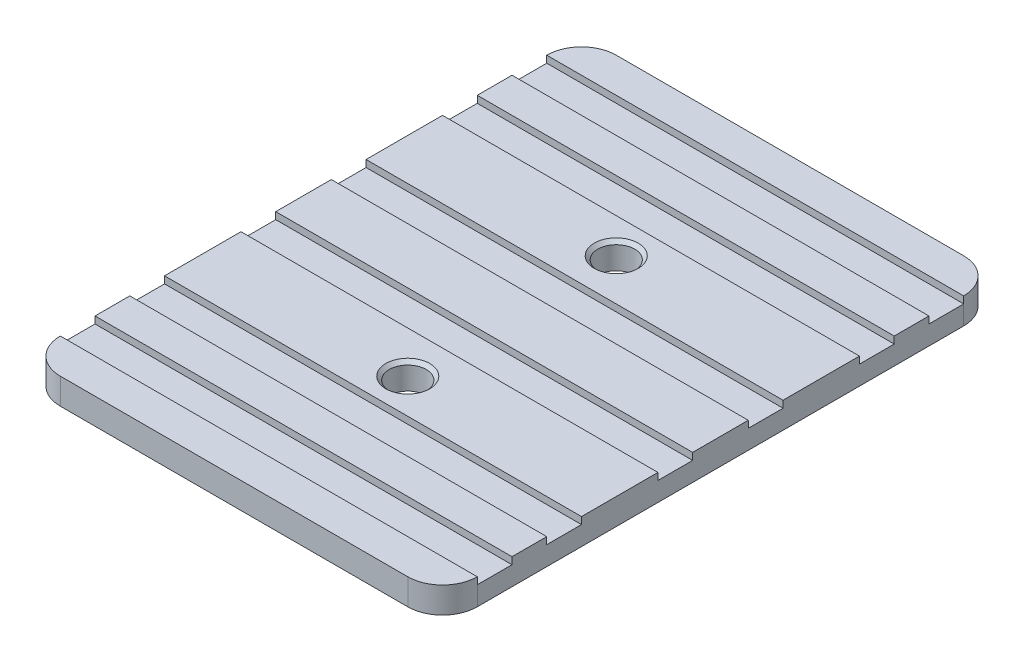
ISO-10303-21;
HEADER;
FILE_DESCRIPTION(('STEP AP214'),'2;1');
FILE_NAME('part.step','',(''),(''),'','','');
FILE_SCHEMA(('AUTOMOTIVE_DESIGN { 1 0 10303 214 1 1 1 1 }'));
ENDSEC;
DATA;
#1=APPLICATION_CONTEXT('core data for automotive mechanical design processes');
#2=APPLICATION_PROTOCOL_DEFINITION('international standard','automotive_design',2000,#1);
#3=PRODUCT_CONTEXT('',#1,'mechanical');
#4=PRODUCT('Part','Part','',(#3));
#5=PRODUCT_RELATED_PRODUCT_CATEGORY('part','',(#4));
#6=PRODUCT_DEFINITION_FORMATION('','',#4);
#7=PRODUCT_DEFINITION_CONTEXT('part definition',#1,'design');
#8=PRODUCT_DEFINITION('design','',#6,#7);
#9=PRODUCT_DEFINITION_SHAPE('','',#8);
#10=(LENGTH_UNIT() NAMED_UNIT(*) SI_UNIT(.MILLI.,.METRE.));
#11=(NAMED_UNIT(*) PLANE_ANGLE_UNIT() SI_UNIT($,.RADIAN.));
#12=(NAMED_UNIT(*) SI_UNIT($,.STERADIAN.) SOLID_ANGLE_UNIT());
#13=UNCERTAINTY_MEASURE_WITH_UNIT(LENGTH_MEASURE(1.E-05),#10,'distance_accuracy_value','');
#14=(GEOMETRIC_REPRESENTATION_CONTEXT(3) GLOBAL_UNCERTAINTY_ASSIGNED_CONTEXT((#13)) GLOBAL_UNIT_ASSIGNED_CONTEXT((#10,
#11,#12)) REPRESENTATION_CONTEXT('',''));
#15=CARTESIAN_POINT('',(0.,0.,0.));
#16=DIRECTION('',(0.,0.,1.));
#17=DIRECTION('',(1.,0.,0.));
#18=AXIS2_PLACEMENT_3D('',#15,#16,#17);
#19=CARTESIAN_POINT('',(0.,4.7625,0.));
#20=DIRECTION('',(0.,1.,0.));
#21=DIRECTION('',(0.,0.,1.));
#22=AXIS2_PLACEMENT_3D('',#19,#20,#21);
#23=PLANE('',#22);
#24=DIRECTION('',(-1.,0.,0.));
#25=VECTOR('',#24,1.);
#26=CARTESIAN_POINT('',(0.,4.7625,6.35));
#27=LINE('',#26,#25);
#28=CARTESIAN_POINT('',(76.2,4.7625,6.35));
#29=VERTEX_POINT('',#28);
#30=CARTESIAN_POINT('',(0.,4.7625,6.35));
#31=VERTEX_POINT('',#30);
#32=EDGE_CURVE('E267',#29,#31,#27,.T.);
#33=ORIENTED_EDGE('',*,*,#32,.F.);
#34=CARTESIAN_POINT('',(69.85,4.7625,6.35));
#35=DIRECTION('',(0.,1.,0.));
#36=DIRECTION('',(0.,0.,1.));
#37=AXIS2_PLACEMENT_3D('',#34,#35,#36);
#38=CIRCLE('',#37,6.35);
#39=CARTESIAN_POINT('',(69.85,4.7625,0.));
#40=VERTEX_POINT('',#39);
#41=EDGE_CURVE('E401',#29,#40,#38,.T.);
#42=ORIENTED_EDGE('',*,*,#41,.T.);
#43=DIRECTION('',(-1.,0.,0.));
#44=VECTOR('',#43,1.);
#45=CARTESIAN_POINT('',(0.,4.7625,0.));
#46=LINE('',#45,#44);
#47=CARTESIAN_POINT('',(6.35,4.7625,0.));
#48=VERTEX_POINT('',#47);
#49=EDGE_CURVE('E358',#40,#48,#46,.T.);
#50=ORIENTED_EDGE('',*,*,#49,.T.);
#51=CARTESIAN_POINT('',(6.35,4.7625,6.35));
#52=DIRECTION('',(0.,1.,0.));
#53=DIRECTION('',(0.,0.,1.));
#54=AXIS2_PLACEMENT_3D('',#51,#52,#53);
#55=CIRCLE('',#54,6.35);
#56=EDGE_CURVE('E408',#48,#31,#55,.T.);
#57=ORIENTED_EDGE('',*,*,#56,.T.);
#58=EDGE_LOOP('',(#33,#42,#50,#57));
#59=FACE_BOUND('',#58,.T.);
#60=ADVANCED_FACE('F52',(#59),#23,.T.);
#61=DIRECTION('',(-1.,0.,0.));
#62=VECTOR('',#61,1.);
#63=CARTESIAN_POINT('',(0.,4.7625,88.9));
#64=LINE('',#63,#62);
#65=CARTESIAN_POINT('',(76.2,4.7625,88.9));
#66=VERTEX_POINT('',#65);
#67=CARTESIAN_POINT('',(0.,4.7625,88.9));
#68=VERTEX_POINT('',#67);
#69=EDGE_CURVE('E930',#66,#68,#64,.T.);
#70=ORIENTED_EDGE('',*,*,#69,.F.);
#71=DIRECTION('',(0.,0.,-1.));
#72=VECTOR('',#71,1.);
#73=CARTESIAN_POINT('',(76.2,4.7625,0.));
#74=LINE('',#73,#72);
#75=CARTESIAN_POINT('',(76.2,4.7625,82.55));
#76=VERTEX_POINT('',#75);
#77=EDGE_CURVE('E364',#66,#76,#74,.T.);
#78=ORIENTED_EDGE('',*,*,#77,.T.);
#79=DIRECTION('',(1.,0.,0.));
#80=VECTOR('',#79,1.);
#81=CARTESIAN_POINT('',(0.,4.7625,82.55));
#82=LINE('',#81,#80);
#83=CARTESIAN_POINT('',(0.,4.7625,82.55));
#84=VERTEX_POINT('',#83);
#85=EDGE_CURVE('E947',#84,#76,#82,.T.);
#86=ORIENTED_EDGE('',*,*,#85,.F.);
#87=DIRECTION('',(0.,0.,1.));
#88=VECTOR('',#87,1.);
#89=CARTESIAN_POINT('',(0.,4.7625,0.));
#90=LINE('',#89,#88);
#91=EDGE_CURVE('E382',#84,#68,#90,.T.);
#92=ORIENTED_EDGE('',*,*,#91,.T.);
#93=EDGE_LOOP('',(#70,#78,#86,#92));
#94=FACE_BOUND('',#93,.T.);
#95=ADVANCED_FACE('F492',(#94),#23,.T.);
#96=DIRECTION('',(-1.,0.,0.));
#97=VECTOR('',#96,1.);
#98=CARTESIAN_POINT('',(0.,4.7625,55.88));
#99=LINE('',#98,#97);
#100=CARTESIAN_POINT('',(76.2,4.7625,55.88));
#101=VERTEX_POINT('',#100);
#102=CARTESIAN_POINT('',(0.,4.7625,55.88));
#103=VERTEX_POINT('',#102);
#104=EDGE_CURVE('E291',#101,#103,#99,.T.);
#105=ORIENTED_EDGE('',*,*,#104,.F.);
#106=CARTESIAN_POINT('',(76.2,4.7625,45.72));
#107=VERTEX_POINT('',#106);
#108=EDGE_CURVE('E534',#101,#107,#74,.T.);
#109=ORIENTED_EDGE('',*,*,#108,.T.);
#110=DIRECTION('',(1.,0.,0.));
#111=VECTOR('',#110,1.);
#112=CARTESIAN_POINT('',(0.,4.7625,45.72));
#113=LINE('',#112,#111);
#114=CARTESIAN_POINT('',(0.,4.7625,45.72));
#115=VERTEX_POINT('',#114);
#116=EDGE_CURVE('E551',#115,#107,#113,.T.);
#117=ORIENTED_EDGE('',*,*,#116,.F.);
#118=EDGE_CURVE('E965',#115,#103,#90,.T.);
#119=ORIENTED_EDGE('',*,*,#118,.T.);
#120=EDGE_LOOP('',(#105,#109,#117,#119));
#121=FACE_BOUND('',#120,.T.);
#122=ADVANCED_FACE('F499',(#121),#23,.T.);
#123=DIRECTION('',(-1.,0.,0.));
#124=VECTOR('',#123,1.);
#125=CARTESIAN_POINT('',(0.,4.7625,39.37));
#126=LINE('',#125,#124);
#127=CARTESIAN_POINT('',(76.2,4.7625,39.37));
#128=VERTEX_POINT('',#127);
#129=CARTESIAN_POINT('',(0.,4.7625,39.37));
#130=VERTEX_POINT('',#129);
#131=EDGE_CURVE('E573',#128,#130,#126,.T.);
#132=ORIENTED_EDGE('',*,*,#131,.F.);
#133=CARTESIAN_POINT('',(76.2,4.7625,25.4));
#134=VERTEX_POINT('',#133);
#135=EDGE_CURVE('E530',#128,#134,#74,.T.);
#136=ORIENTED_EDGE('',*,*,#135,.T.);
#137=DIRECTION('',(1.,0.,0.));
#138=VECTOR('',#137,1.);
#139=CARTESIAN_POINT('',(76.2,4.7625,25.4));
#140=LINE('',#139,#138);
#141=CARTESIAN_POINT('',(0.,4.7625,25.4));
#142=VERTEX_POINT('',#141);
#143=EDGE_CURVE('E336',#142,#134,#140,.T.);
#144=ORIENTED_EDGE('',*,*,#143,.F.);
#145=EDGE_CURVE('E604',#142,#130,#90,.T.);
#146=ORIENTED_EDGE('',*,*,#145,.T.);
#147=EDGE_LOOP('',(#132,#136,#144,#146));
#148=FACE_BOUND('',#147,.T.);
#149=CARTESIAN_POINT('',(38.1,4.7625,31.75));
#150=DIRECTION('',(0.,1.,0.));
#151=DIRECTION('',(0.,0.,1.));
#152=AXIS2_PLACEMENT_3D('',#149,#150,#151);
#153=CIRCLE('',#152,4.0132);
#154=CARTESIAN_POINT('',(38.1,4.7625,35.7632));
#155=VERTEX_POINT('',#154);
#156=EDGE_CURVE('E355',#155,#155,#153,.T.);
#157=ORIENTED_EDGE('',*,*,#156,.F.);
#158=EDGE_LOOP('',(#157));
#159=FACE_BOUND('',#158,.T.);
#160=ADVANCED_FACE('F521',(#148,#159),#23,.T.);
#161=DIRECTION('',(1.,0.,0.));
#162=VECTOR('',#161,1.);
#163=CARTESIAN_POINT('',(0.,4.7625,62.23));
#164=LINE('',#163,#162);
#165=CARTESIAN_POINT('',(0.,4.7625,62.23));
#166=VERTEX_POINT('',#165);
#167=CARTESIAN_POINT('',(76.2,4.7625,62.23));
#168=VERTEX_POINT('',#167);
#169=EDGE_CURVE('E295',#166,#168,#164,.T.);
#170=ORIENTED_EDGE('',*,*,#169,.F.);
#171=CARTESIAN_POINT('',(0.,4.7625,76.2));
#172=VERTEX_POINT('',#171);
#173=EDGE_CURVE('E964',#166,#172,#90,.T.);
#174=ORIENTED_EDGE('',*,*,#173,.T.);
#175=DIRECTION('',(-1.,0.,0.));
#176=VECTOR('',#175,1.);
#177=CARTESIAN_POINT('',(76.2,4.7625,76.2));
#178=LINE('',#177,#176);
#179=CARTESIAN_POINT('',(76.2,4.7625,76.2));
#180=VERTEX_POINT('',#179);
#181=EDGE_CURVE('E459',#180,#172,#178,.T.);
#182=ORIENTED_EDGE('',*,*,#181,.F.);
#183=EDGE_CURVE('E537',#180,#168,#74,.T.);
#184=ORIENTED_EDGE('',*,*,#183,.T.);
#185=EDGE_LOOP('',(#170,#174,#182,#184));
#186=FACE_BOUND('',#185,.T.);
#187=CARTESIAN_POINT('',(38.1,4.7625,69.85));
#188=DIRECTION('',(0.,1.,0.));
#189=DIRECTION('',(0.,0.,1.));
#190=AXIS2_PLACEMENT_3D('',#187,#188,#189);
#191=CIRCLE('',#190,4.0132);
#192=CARTESIAN_POINT('',(38.1,4.7625,73.8632));
#193=VERTEX_POINT('',#192);
#194=EDGE_CURVE('E308',#193,#193,#191,.T.);
#195=ORIENTED_EDGE('',*,*,#194,.F.);
#196=EDGE_LOOP('',(#195));
#197=FACE_BOUND('',#196,.T.);
#198=ADVANCED_FACE('F512',(#186,#197),#23,.T.);
#199=DIRECTION('',(1.,0.,0.));
#200=VECTOR('',#199,1.);
#201=CARTESIAN_POINT('',(0.,4.7625,12.7));
#202=LINE('',#201,#200);
#203=CARTESIAN_POINT('',(0.,4.7625,12.7));
#204=VERTEX_POINT('',#203);
#205=CARTESIAN_POINT('',(76.2,4.7625,12.7));
#206=VERTEX_POINT('',#205);
#207=EDGE_CURVE('E454',#204,#206,#202,.T.);
#208=ORIENTED_EDGE('',*,*,#207,.F.);
#209=CARTESIAN_POINT('',(0.,4.7625,19.05));
#210=VERTEX_POINT('',#209);
#211=EDGE_CURVE('E273',#204,#210,#90,.T.);
#212=ORIENTED_EDGE('',*,*,#211,.T.);
#213=DIRECTION('',(-1.,0.,0.));
#214=VECTOR('',#213,1.);
#215=CARTESIAN_POINT('',(0.,4.7625,19.05));
#216=LINE('',#215,#214);
#217=CARTESIAN_POINT('',(76.2,4.7625,19.05));
#218=VERTEX_POINT('',#217);
#219=EDGE_CURVE('E331',#218,#210,#216,.T.);
#220=ORIENTED_EDGE('',*,*,#219,.F.);
#221=EDGE_CURVE('E365',#218,#206,#74,.T.);
#222=ORIENTED_EDGE('',*,*,#221,.T.);
#223=EDGE_LOOP('',(#208,#212,#220,#222));
#224=FACE_BOUND('',#223,.T.);
#225=ADVANCED_FACE('F505',(#224),#23,.T.);
#226=CARTESIAN_POINT('',(0.,4.7625,0.));
#227=DIRECTION('',(1.,0.,0.));
#228=DIRECTION('',(0.,0.,-1.));
#229=AXIS2_PLACEMENT_3D('',#226,#227,#228);
#230=PLANE('',#229);
#231=ORIENTED_EDGE('',*,*,#211,.F.);
#232=DIRECTION('',(0.,1.,0.));
#233=VECTOR('',#232,1.);
#234=CARTESIAN_POINT('',(0.,3.4925,12.7));
#235=LINE('',#234,#233);
#236=CARTESIAN_POINT('',(0.,3.4925,12.7));
#237=VERTEX_POINT('',#236);
#238=EDGE_CURVE('E251',#237,#204,#235,.T.);
#239=ORIENTED_EDGE('',*,*,#238,.F.);
#240=DIRECTION('',(0.,0.,1.));
#241=VECTOR('',#240,1.);
#242=CARTESIAN_POINT('',(0.,3.4925,6.35));
#243=LINE('',#242,#241);
#244=CARTESIAN_POINT('',(0.,3.4925,6.35));
#245=VERTEX_POINT('',#244);
#246=EDGE_CURVE('E259',#245,#237,#243,.T.);
#247=ORIENTED_EDGE('',*,*,#246,.F.);
#248=DIRECTION('',(0.,-1.,0.));
#249=VECTOR('',#248,1.);
#250=CARTESIAN_POINT('',(0.,4.7625,6.35));
#251=LINE('',#250,#249);
#252=CARTESIAN_POINT('',(0.,0.,6.35));
#253=VERTEX_POINT('',#252);
#254=EDGE_CURVE('E385',#245,#253,#251,.T.);
#255=ORIENTED_EDGE('',*,*,#254,.T.);
#256=DIRECTION('',(0.,0.,1.));
#257=VECTOR('',#256,1.);
#258=CARTESIAN_POINT('',(0.,0.,0.));
#259=LINE('',#258,#257);
#260=CARTESIAN_POINT('',(0.,0.,95.25));
#261=VERTEX_POINT('',#260);
#262=EDGE_CURVE('E368',#253,#261,#259,.T.);
#263=ORIENTED_EDGE('',*,*,#262,.T.);
#264=DIRECTION('',(0.,-1.,0.));
#265=VECTOR('',#264,1.);
#266=CARTESIAN_POINT('',(0.,4.7625,95.25));
#267=LINE('',#266,#265);
#268=CARTESIAN_POINT('',(0.,3.4925,95.25));
#269=VERTEX_POINT('',#268);
#270=EDGE_CURVE('E363',#261,#269,#267,.F.);
#271=ORIENTED_EDGE('',*,*,#270,.T.);
#272=DIRECTION('',(0.,0.,1.));
#273=VECTOR('',#272,1.);
#274=CARTESIAN_POINT('',(0.,3.4925,88.9));
#275=LINE('',#274,#273);
#276=CARTESIAN_POINT('',(0.,3.4925,88.9));
#277=VERTEX_POINT('',#276);
#278=EDGE_CURVE('E925',#277,#269,#275,.T.);
#279=ORIENTED_EDGE('',*,*,#278,.F.);
#280=DIRECTION('',(0.,1.,0.));
#281=VECTOR('',#280,1.);
#282=CARTESIAN_POINT('',(0.,3.4925,88.9));
#283=LINE('',#282,#281);
#284=EDGE_CURVE('E335',#277,#68,#283,.T.);
#285=ORIENTED_EDGE('',*,*,#284,.T.);
#286=ORIENTED_EDGE('',*,*,#91,.F.);
#287=DIRECTION('',(0.,1.,0.));
#288=VECTOR('',#287,1.);
#289=CARTESIAN_POINT('',(0.,3.4925,82.55));
#290=LINE('',#289,#288);
#291=CARTESIAN_POINT('',(0.,3.4925,82.55));
#292=VERTEX_POINT('',#291);
#293=EDGE_CURVE('E67',#292,#84,#290,.T.);
#294=ORIENTED_EDGE('',*,*,#293,.F.);
#295=DIRECTION('',(0.,0.,1.));
#296=VECTOR('',#295,1.);
#297=CARTESIAN_POINT('',(0.,3.4925,76.2));
#298=LINE('',#297,#296);
#299=CARTESIAN_POINT('',(0.,3.4925,76.2));
#300=VERTEX_POINT('',#299);
#301=EDGE_CURVE('E956',#300,#292,#298,.T.);
#302=ORIENTED_EDGE('',*,*,#301,.F.);
#303=DIRECTION('',(0.,1.,0.));
#304=VECTOR('',#303,1.);
#305=CARTESIAN_POINT('',(0.,3.4925,76.2));
#306=LINE('',#305,#304);
#307=EDGE_CURVE('E937',#300,#172,#306,.T.);
#308=ORIENTED_EDGE('',*,*,#307,.T.);
#309=ORIENTED_EDGE('',*,*,#173,.F.);
#310=DIRECTION('',(0.,1.,0.));
#311=VECTOR('',#310,1.);
#312=CARTESIAN_POINT('',(0.,3.4925,62.23));
#313=LINE('',#312,#311);
#314=CARTESIAN_POINT('',(0.,3.4925,62.23));
#315=VERTEX_POINT('',#314);
#316=EDGE_CURVE('E75',#315,#166,#313,.T.);
#317=ORIENTED_EDGE('',*,*,#316,.F.);
#318=DIRECTION('',(0.,0.,1.));
#319=VECTOR('',#318,1.);
#320=CARTESIAN_POINT('',(0.,3.4925,55.88));
#321=LINE('',#320,#319);
#322=CARTESIAN_POINT('',(0.,3.4925,55.88));
#323=VERTEX_POINT('',#322);
#324=EDGE_CURVE('E296',#323,#315,#321,.T.);
#325=ORIENTED_EDGE('',*,*,#324,.F.);
#326=DIRECTION('',(0.,1.,0.));
#327=VECTOR('',#326,1.);
#328=CARTESIAN_POINT('',(0.,3.4925,55.88));
#329=LINE('',#328,#327);
#330=EDGE_CURVE('E287',#323,#103,#329,.T.);
#331=ORIENTED_EDGE('',*,*,#330,.T.);
#332=ORIENTED_EDGE('',*,*,#118,.F.);
#333=DIRECTION('',(0.,1.,0.));
#334=VECTOR('',#333,1.);
#335=CARTESIAN_POINT('',(0.,3.4925,45.72));
#336=LINE('',#335,#334);
#337=CARTESIAN_POINT('',(0.,3.4925,45.72));
#338=VERTEX_POINT('',#337);
#339=EDGE_CURVE('E562',#338,#115,#336,.T.);
#340=ORIENTED_EDGE('',*,*,#339,.F.);
#341=DIRECTION('',(0.,0.,1.));
#342=VECTOR('',#341,1.);
#343=CARTESIAN_POINT('',(0.,3.4925,39.37));
#344=LINE('',#343,#342);
#345=CARTESIAN_POINT('',(0.,3.4925,39.37));
#346=VERTEX_POINT('',#345);
#347=EDGE_CURVE('E575',#346,#338,#344,.T.);
#348=ORIENTED_EDGE('',*,*,#347,.F.);
#349=DIRECTION('',(0.,1.,0.));
#350=VECTOR('',#349,1.);
#351=CARTESIAN_POINT('',(0.,3.4925,39.37));
#352=LINE('',#351,#350);
#353=EDGE_CURVE('E567',#346,#130,#352,.T.);
#354=ORIENTED_EDGE('',*,*,#353,.T.);
#355=ORIENTED_EDGE('',*,*,#145,.F.);
#356=DIRECTION('',(0.,1.,0.));
#357=VECTOR('',#356,1.);
#358=CARTESIAN_POINT('',(0.,3.4925,25.4));
#359=LINE('',#358,#357);
#360=CARTESIAN_POINT('',(0.,3.4925,25.4));
#361=VERTEX_POINT('',#360);
#362=EDGE_CURVE('E587',#361,#142,#359,.T.);
#363=ORIENTED_EDGE('',*,*,#362,.F.);
#364=DIRECTION('',(0.,0.,1.));
#365=VECTOR('',#364,1.);
#366=CARTESIAN_POINT('',(0.,3.4925,25.4));
#367=LINE('',#366,#365);
#368=CARTESIAN_POINT('',(0.,3.4925,19.05));
#369=VERTEX_POINT('',#368);
#370=EDGE_CURVE('E346',#369,#361,#367,.T.);
#371=ORIENTED_EDGE('',*,*,#370,.F.);
#372=DIRECTION('',(0.,1.,0.));
#373=VECTOR('',#372,1.);
#374=CARTESIAN_POINT('',(0.,3.4925,19.05));
#375=LINE('',#374,#373);
#376=EDGE_CURVE('E343',#369,#210,#375,.T.);
#377=ORIENTED_EDGE('',*,*,#376,.T.);
#378=EDGE_LOOP('',(#231,#239,#247,#255,#263,#271,#279,#285,#286,#294,#302,#308,#309,#317,#325,
#331,#332,#340,#348,#354,#355,#363,#371,#377));
#379=FACE_BOUND('',#378,.T.);
#380=ADVANCED_FACE('F270',(#379),#230,.F.);
#381=CARTESIAN_POINT('',(0.,4.7625,101.6));
#382=DIRECTION('',(0.,0.,-1.));
#383=DIRECTION('',(-1.,0.,0.));
#384=AXIS2_PLACEMENT_3D('',#381,#382,#383);
#385=PLANE('',#384);
#386=DIRECTION('',(1.,0.,0.));
#387=VECTOR('',#386,1.);
#388=CARTESIAN_POINT('',(0.,4.7625,101.6));
#389=LINE('',#388,#387);
#390=CARTESIAN_POINT('',(6.35000000000002,4.7625,101.6));
#391=VERTEX_POINT('',#390);
#392=CARTESIAN_POINT('',(69.85,4.7625,101.6));
#393=VERTEX_POINT('',#392);
#394=EDGE_CURVE('E531',#391,#393,#389,.T.);
#395=ORIENTED_EDGE('',*,*,#394,.F.);
#396=DIRECTION('',(0.,-1.,0.));
#397=VECTOR('',#396,1.);
#398=CARTESIAN_POINT('',(6.35000000000002,4.7625,101.6));
#399=LINE('',#398,#397);
#400=CARTESIAN_POINT('',(6.35000000000002,0.,101.6));
#401=VERTEX_POINT('',#400);
#402=EDGE_CURVE('E413',#391,#401,#399,.T.);
#403=ORIENTED_EDGE('',*,*,#402,.T.);
#404=DIRECTION('',(1.,0.,0.));
#405=VECTOR('',#404,1.);
#406=CARTESIAN_POINT('',(0.,0.,101.6));
#407=LINE('',#406,#405);
#408=CARTESIAN_POINT('',(69.85,0.,101.6));
#409=VERTEX_POINT('',#408);
#410=EDGE_CURVE('E371',#401,#409,#407,.T.);
#411=ORIENTED_EDGE('',*,*,#410,.T.);
#412=DIRECTION('',(0.,-1.,0.));
#413=VECTOR('',#412,1.);
#414=CARTESIAN_POINT('',(69.85,4.7625,101.6));
#415=LINE('',#414,#413);
#416=EDGE_CURVE('E411',#409,#393,#415,.F.);
#417=ORIENTED_EDGE('',*,*,#416,.T.);
#418=EDGE_LOOP('',(#395,#403,#411,#417));
#419=FACE_BOUND('',#418,.T.);
#420=ADVANCED_FACE('F518',(#419),#385,.F.);
#421=CARTESIAN_POINT('',(76.2,4.7625,0.));
#422=DIRECTION('',(-1.,0.,0.));
#423=DIRECTION('',(0.,0.,1.));
#424=AXIS2_PLACEMENT_3D('',#421,#422,#423);
#425=PLANE('',#424);
#426=DIRECTION('',(0.,0.,-1.));
#427=VECTOR('',#426,1.);
#428=CARTESIAN_POINT('',(76.2,3.4925,12.7));
#429=LINE('',#428,#427);
#430=CARTESIAN_POINT('',(76.2,3.4925,12.7));
#431=VERTEX_POINT('',#430);
#432=CARTESIAN_POINT('',(76.2,3.4925,6.35));
#433=VERTEX_POINT('',#432);
#434=EDGE_CURVE('E258',#431,#433,#429,.T.);
#435=ORIENTED_EDGE('',*,*,#434,.F.);
#436=DIRECTION('',(0.,1.,0.));
#437=VECTOR('',#436,1.);
#438=CARTESIAN_POINT('',(76.2,3.4925,12.7));
#439=LINE('',#438,#437);
#440=EDGE_CURVE('E254',#431,#206,#439,.T.);
#441=ORIENTED_EDGE('',*,*,#440,.T.);
#442=ORIENTED_EDGE('',*,*,#221,.F.);
#443=DIRECTION('',(0.,1.,0.));
#444=VECTOR('',#443,1.);
#445=CARTESIAN_POINT('',(76.2,3.4925,19.05));
#446=LINE('',#445,#444);
#447=CARTESIAN_POINT('',(76.2,3.4925,19.05));
#448=VERTEX_POINT('',#447);
#449=EDGE_CURVE('E529',#448,#218,#446,.T.);
#450=ORIENTED_EDGE('',*,*,#449,.F.);
#451=DIRECTION('',(0.,0.,-1.));
#452=VECTOR('',#451,1.);
#453=CARTESIAN_POINT('',(76.2,3.4925,19.05));
#454=LINE('',#453,#452);
#455=CARTESIAN_POINT('',(76.2,3.4925,25.4));
#456=VERTEX_POINT('',#455);
#457=EDGE_CURVE('E339',#456,#448,#454,.T.);
#458=ORIENTED_EDGE('',*,*,#457,.F.);
#459=DIRECTION('',(0.,1.,0.));
#460=VECTOR('',#459,1.);
#461=CARTESIAN_POINT('',(76.2,3.4925,25.4));
#462=LINE('',#461,#460);
#463=EDGE_CURVE('E589',#456,#134,#462,.T.);
#464=ORIENTED_EDGE('',*,*,#463,.T.);
#465=ORIENTED_EDGE('',*,*,#135,.F.);
#466=DIRECTION('',(0.,1.,0.));
#467=VECTOR('',#466,1.);
#468=CARTESIAN_POINT('',(76.2,3.4925,39.37));
#469=LINE('',#468,#467);
#470=CARTESIAN_POINT('',(76.2,3.4925,39.37));
#471=VERTEX_POINT('',#470);
#472=EDGE_CURVE('E563',#471,#128,#469,.T.);
#473=ORIENTED_EDGE('',*,*,#472,.F.);
#474=DIRECTION('',(0.,0.,-1.));
#475=VECTOR('',#474,1.);
#476=CARTESIAN_POINT('',(76.2,3.4925,45.72));
#477=LINE('',#476,#475);
#478=CARTESIAN_POINT('',(76.2,3.4925,45.72));
#479=VERTEX_POINT('',#478);
#480=EDGE_CURVE('E559',#479,#471,#477,.T.);
#481=ORIENTED_EDGE('',*,*,#480,.F.);
#482=DIRECTION('',(0.,1.,0.));
#483=VECTOR('',#482,1.);
#484=CARTESIAN_POINT('',(76.2,3.4925,45.72));
#485=LINE('',#484,#483);
#486=EDGE_CURVE('E557',#479,#107,#485,.T.);
#487=ORIENTED_EDGE('',*,*,#486,.T.);
#488=ORIENTED_EDGE('',*,*,#108,.F.);
#489=DIRECTION('',(0.,1.,0.));
#490=VECTOR('',#489,1.);
#491=CARTESIAN_POINT('',(76.2,3.4925,55.88));
#492=LINE('',#491,#490);
#493=CARTESIAN_POINT('',(76.2,3.4925,55.88));
#494=VERTEX_POINT('',#493);
#495=EDGE_CURVE('E285',#494,#101,#492,.T.);
#496=ORIENTED_EDGE('',*,*,#495,.F.);
#497=DIRECTION('',(0.,0.,-1.));
#498=VECTOR('',#497,1.);
#499=CARTESIAN_POINT('',(76.2,3.4925,62.23));
#500=LINE('',#499,#498);
#501=CARTESIAN_POINT('',(76.2,3.4925,62.23));
#502=VERTEX_POINT('',#501);
#503=EDGE_CURVE('E972',#502,#494,#500,.T.);
#504=ORIENTED_EDGE('',*,*,#503,.F.);
#505=DIRECTION('',(0.,1.,0.));
#506=VECTOR('',#505,1.);
#507=CARTESIAN_POINT('',(76.2,3.4925,62.23));
#508=LINE('',#507,#506);
#509=EDGE_CURVE('E282',#502,#168,#508,.T.);
#510=ORIENTED_EDGE('',*,*,#509,.T.);
#511=ORIENTED_EDGE('',*,*,#183,.F.);
#512=DIRECTION('',(0.,1.,0.));
#513=VECTOR('',#512,1.);
#514=CARTESIAN_POINT('',(76.2,3.4925,76.2));
#515=LINE('',#514,#513);
#516=CARTESIAN_POINT('',(76.2,3.4925,76.2));
#517=VERTEX_POINT('',#516);
#518=EDGE_CURVE('E577',#517,#180,#515,.T.);
#519=ORIENTED_EDGE('',*,*,#518,.F.);
#520=DIRECTION('',(0.,0.,-1.));
#521=VECTOR('',#520,1.);
#522=CARTESIAN_POINT('',(76.2,3.4925,82.55));
#523=LINE('',#522,#521);
#524=CARTESIAN_POINT('',(76.2,3.4925,82.55));
#525=VERTEX_POINT('',#524);
#526=EDGE_CURVE('E940',#525,#517,#523,.T.);
#527=ORIENTED_EDGE('',*,*,#526,.F.);
#528=DIRECTION('',(0.,1.,0.));
#529=VECTOR('',#528,1.);
#530=CARTESIAN_POINT('',(76.2,3.4925,82.55));
#531=LINE('',#530,#529);
#532=EDGE_CURVE('E942',#525,#76,#531,.T.);
#533=ORIENTED_EDGE('',*,*,#532,.T.);
#534=ORIENTED_EDGE('',*,*,#77,.F.);
#535=DIRECTION('',(0.,1.,0.));
#536=VECTOR('',#535,1.);
#537=CARTESIAN_POINT('',(76.2,3.4925,88.9));
#538=LINE('',#537,#536);
#539=CARTESIAN_POINT('',(76.2,3.4925,88.9));
#540=VERTEX_POINT('',#539);
#541=EDGE_CURVE('E983',#540,#66,#538,.T.);
#542=ORIENTED_EDGE('',*,*,#541,.F.);
#543=DIRECTION('',(0.,0.,-1.));
#544=VECTOR('',#543,1.);
#545=CARTESIAN_POINT('',(76.2,3.4925,95.25));
#546=LINE('',#545,#544);
#547=CARTESIAN_POINT('',(76.2,3.4925,95.25));
#548=VERTEX_POINT('',#547);
#549=EDGE_CURVE('E425',#548,#540,#546,.T.);
#550=ORIENTED_EDGE('',*,*,#549,.F.);
#551=DIRECTION('',(0.,-1.,0.));
#552=VECTOR('',#551,1.);
#553=CARTESIAN_POINT('',(76.2,4.7625,95.25));
#554=LINE('',#553,#552);
#555=CARTESIAN_POINT('',(76.2,0.,95.25));
#556=VERTEX_POINT('',#555);
#557=EDGE_CURVE('E60',#548,#556,#554,.T.);
#558=ORIENTED_EDGE('',*,*,#557,.T.);
#559=DIRECTION('',(0.,0.,-1.));
#560=VECTOR('',#559,1.);
#561=CARTESIAN_POINT('',(76.2,0.,0.));
#562=LINE('',#561,#560);
#563=CARTESIAN_POINT('',(76.2,0.,6.35));
#564=VERTEX_POINT('',#563);
#565=EDGE_CURVE('E374',#556,#564,#562,.T.);
#566=ORIENTED_EDGE('',*,*,#565,.T.);
#567=DIRECTION('',(0.,-1.,0.));
#568=VECTOR('',#567,1.);
#569=CARTESIAN_POINT('',(76.2,4.7625,6.35));
#570=LINE('',#569,#568);
#571=EDGE_CURVE('E415',#564,#433,#570,.F.);
#572=ORIENTED_EDGE('',*,*,#571,.T.);
#573=EDGE_LOOP('',(#435,#441,#442,#450,#458,#464,#465,#473,#481,#487,#488,#496,#504,#510,#511,
#519,#527,#533,#534,#542,#550,#558,#566,#572));
#574=FACE_BOUND('',#573,.T.);
#575=ADVANCED_FACE('F422',(#574),#425,.F.);
#576=CARTESIAN_POINT('',(0.,4.7625,0.));
#577=DIRECTION('',(0.,0.,1.));
#578=DIRECTION('',(1.,0.,0.));
#579=AXIS2_PLACEMENT_3D('',#576,#577,#578);
#580=PLANE('',#579);
#581=DIRECTION('',(-1.,0.,0.));
#582=VECTOR('',#581,1.);
#583=CARTESIAN_POINT('',(0.,0.,0.));
#584=LINE('',#583,#582);
#585=CARTESIAN_POINT('',(69.85,0.,0.));
#586=VERTEX_POINT('',#585);
#587=CARTESIAN_POINT('',(6.35,0.,0.));
#588=VERTEX_POINT('',#587);
#589=EDGE_CURVE('E379',#586,#588,#584,.T.);
#590=ORIENTED_EDGE('',*,*,#589,.T.);
#591=DIRECTION('',(0.,-1.,0.));
#592=VECTOR('',#591,1.);
#593=CARTESIAN_POINT('',(6.35,4.7625,0.));
#594=LINE('',#593,#592);
#595=EDGE_CURVE('E399',#588,#48,#594,.F.);
#596=ORIENTED_EDGE('',*,*,#595,.T.);
#597=ORIENTED_EDGE('',*,*,#49,.F.);
#598=DIRECTION('',(0.,-1.,0.));
#599=VECTOR('',#598,1.);
#600=CARTESIAN_POINT('',(69.85,4.7625,0.));
#601=LINE('',#600,#599);
#602=EDGE_CURVE('E396',#40,#586,#601,.T.);
#603=ORIENTED_EDGE('',*,*,#602,.T.);
#604=EDGE_LOOP('',(#590,#596,#597,#603));
#605=FACE_BOUND('',#604,.T.);
#606=ADVANCED_FACE('F442',(#605),#580,.F.);
#607=DIRECTION('',(1.,0.,0.));
#608=VECTOR('',#607,1.);
#609=CARTESIAN_POINT('',(0.,4.7625,95.25));
#610=LINE('',#609,#608);
#611=CARTESIAN_POINT('',(0.,4.7625,95.25));
#612=VERTEX_POINT('',#611);
#613=CARTESIAN_POINT('',(76.2,4.7625,95.25));
#614=VERTEX_POINT('',#613);
#615=EDGE_CURVE('E290',#612,#614,#610,.T.);
#616=ORIENTED_EDGE('',*,*,#615,.F.);
#617=CARTESIAN_POINT('',(6.35000000000002,4.7625,95.25));
#618=DIRECTION('',(0.,1.,0.));
#619=DIRECTION('',(0.,0.,1.));
#620=AXIS2_PLACEMENT_3D('',#617,#618,#619);
#621=CIRCLE('',#620,6.35);
#622=EDGE_CURVE('E406',#612,#391,#621,.T.);
#623=ORIENTED_EDGE('',*,*,#622,.T.);
#624=ORIENTED_EDGE('',*,*,#394,.T.);
#625=CARTESIAN_POINT('',(69.85,4.7625,95.25));
#626=DIRECTION('',(0.,1.,0.));
#627=DIRECTION('',(0.,0.,1.));
#628=AXIS2_PLACEMENT_3D('',#625,#626,#627);
#629=CIRCLE('',#628,6.35);
#630=EDGE_CURVE('E403',#393,#614,#629,.T.);
#631=ORIENTED_EDGE('',*,*,#630,.T.);
#632=EDGE_LOOP('',(#616,#623,#624,#631));
#633=FACE_BOUND('',#632,.T.);
#634=ADVANCED_FACE('F494',(#633),#23,.T.);
#635=CARTESIAN_POINT('',(0.,0.,0.));
#636=DIRECTION('',(0.,1.,0.));
#637=DIRECTION('',(0.,0.,1.));
#638=AXIS2_PLACEMENT_3D('',#635,#636,#637);
#639=PLANE('',#638);
#640=CARTESIAN_POINT('',(38.1,0.,31.75));
#641=DIRECTION('',(0.,1.,0.));
#642=DIRECTION('',(0.,0.,1.));
#643=AXIS2_PLACEMENT_3D('',#640,#641,#642);
#644=CIRCLE('',#643,3.3782);
#645=CARTESIAN_POINT('',(38.1,0.,35.1282));
#646=VERTEX_POINT('',#645);
#647=EDGE_CURVE('E315',#646,#646,#644,.T.);
#648=ORIENTED_EDGE('',*,*,#647,.T.);
#649=EDGE_LOOP('',(#648));
#650=FACE_BOUND('',#649,.T.);
#651=CARTESIAN_POINT('',(38.1,0.,69.85));
#652=DIRECTION('',(0.,1.,0.));
#653=DIRECTION('',(0.,0.,1.));
#654=AXIS2_PLACEMENT_3D('',#651,#652,#653);
#655=CIRCLE('',#654,3.3782);
#656=CARTESIAN_POINT('',(38.1,0.,73.2282));
#657=VERTEX_POINT('',#656);
#658=EDGE_CURVE('E321',#657,#657,#655,.T.);
#659=ORIENTED_EDGE('',*,*,#658,.T.);
#660=EDGE_LOOP('',(#659));
#661=FACE_BOUND('',#660,.T.);
#662=ORIENTED_EDGE('',*,*,#262,.F.);
#663=CARTESIAN_POINT('',(6.35,0.,6.35));
#664=DIRECTION('',(0.,1.,0.));
#665=DIRECTION('',(0.,0.,1.));
#666=AXIS2_PLACEMENT_3D('',#663,#664,#665);
#667=CIRCLE('',#666,6.35);
#668=EDGE_CURVE('E394',#253,#588,#667,.F.);
#669=ORIENTED_EDGE('',*,*,#668,.T.);
#670=ORIENTED_EDGE('',*,*,#589,.F.);
#671=CARTESIAN_POINT('',(69.85,0.,6.35));
#672=DIRECTION('',(0.,1.,0.));
#673=DIRECTION('',(0.,0.,1.));
#674=AXIS2_PLACEMENT_3D('',#671,#672,#673);
#675=CIRCLE('',#674,6.35);
#676=EDGE_CURVE('E388',#586,#564,#675,.F.);
#677=ORIENTED_EDGE('',*,*,#676,.T.);
#678=ORIENTED_EDGE('',*,*,#565,.F.);
#679=CARTESIAN_POINT('',(69.85,0.,95.25));
#680=DIRECTION('',(0.,1.,0.));
#681=DIRECTION('',(0.,0.,1.));
#682=AXIS2_PLACEMENT_3D('',#679,#680,#681);
#683=CIRCLE('',#682,6.35);
#684=EDGE_CURVE('E390',#556,#409,#683,.F.);
#685=ORIENTED_EDGE('',*,*,#684,.T.);
#686=ORIENTED_EDGE('',*,*,#410,.F.);
#687=CARTESIAN_POINT('',(6.35000000000002,0.,95.25));
#688=DIRECTION('',(0.,1.,0.));
#689=DIRECTION('',(0.,0.,1.));
#690=AXIS2_PLACEMENT_3D('',#687,#688,#689);
#691=CIRCLE('',#690,6.35);
#692=EDGE_CURVE('E392',#401,#261,#691,.F.);
#693=ORIENTED_EDGE('',*,*,#692,.T.);
#694=EDGE_LOOP('',(#662,#669,#670,#677,#678,#685,#686,#693));
#695=FACE_BOUND('',#694,.T.);
#696=ADVANCED_FACE('F434',(#650,#661,#695),#639,.F.);
#697=CARTESIAN_POINT('',(38.1,4.7625,69.85));
#698=DIRECTION('',(0.,1.,0.));
#699=DIRECTION('',(0.,0.,1.));
#700=AXIS2_PLACEMENT_3D('',#697,#698,#699);
#701=CYLINDRICAL_SURFACE('',#700,3.3782);
#702=ORIENTED_EDGE('',*,*,#658,.F.);
#703=EDGE_LOOP('',(#702));
#704=FACE_BOUND('',#703,.T.);
#705=CARTESIAN_POINT('',(38.1,4.1275,69.85));
#706=DIRECTION('',(0.,1.,0.));
#707=DIRECTION('',(0.,0.,1.));
#708=AXIS2_PLACEMENT_3D('',#705,#706,#707);
#709=CIRCLE('',#708,3.3782);
#710=CARTESIAN_POINT('',(38.1,4.1275,73.2282));
#711=VERTEX_POINT('',#710);
#712=EDGE_CURVE('E314',#711,#711,#709,.T.);
#713=ORIENTED_EDGE('',*,*,#712,.T.);
#714=EDGE_LOOP('',(#713));
#715=FACE_BOUND('',#714,.T.);
#716=ADVANCED_FACE('F488',(#704,#715),#701,.F.);
#717=CARTESIAN_POINT('',(38.1,4.7625,69.85));
#718=DIRECTION('',(0.,1.,0.));
#719=DIRECTION('',(0.,0.,1.));
#720=AXIS2_PLACEMENT_3D('',#717,#718,#719);
#721=CONICAL_SURFACE('',#720,4.0132,0.785398163397451);
#722=ORIENTED_EDGE('',*,*,#712,.F.);
#723=EDGE_LOOP('',(#722));
#724=FACE_BOUND('',#723,.T.);
#725=ORIENTED_EDGE('',*,*,#194,.T.);
#726=EDGE_LOOP('',(#725));
#727=FACE_BOUND('',#726,.T.);
#728=ADVANCED_FACE('F480',(#724,#727),#721,.F.);
#729=CARTESIAN_POINT('',(38.1,4.7625,31.75));
#730=DIRECTION('',(0.,1.,0.));
#731=DIRECTION('',(0.,0.,1.));
#732=AXIS2_PLACEMENT_3D('',#729,#730,#731);
#733=CYLINDRICAL_SURFACE('',#732,3.3782);
#734=ORIENTED_EDGE('',*,*,#647,.F.);
#735=EDGE_LOOP('',(#734));
#736=FACE_BOUND('',#735,.T.);
#737=CARTESIAN_POINT('',(38.1,4.1275,31.75));
#738=DIRECTION('',(0.,1.,0.));
#739=DIRECTION('',(0.,0.,1.));
#740=AXIS2_PLACEMENT_3D('',#737,#738,#739);
#741=CIRCLE('',#740,3.3782);
#742=CARTESIAN_POINT('',(38.1,4.1275,35.1282));
#743=VERTEX_POINT('',#742);
#744=EDGE_CURVE('E463',#743,#743,#741,.T.);
#745=ORIENTED_EDGE('',*,*,#744,.T.);
#746=EDGE_LOOP('',(#745));
#747=FACE_BOUND('',#746,.T.);
#748=ADVANCED_FACE('F477',(#736,#747),#733,.F.);
#749=CARTESIAN_POINT('',(38.1,4.7625,31.75));
#750=DIRECTION('',(0.,1.,0.));
#751=DIRECTION('',(0.,0.,1.));
#752=AXIS2_PLACEMENT_3D('',#749,#750,#751);
#753=CONICAL_SURFACE('',#752,4.0132,0.785398163397451);
#754=ORIENTED_EDGE('',*,*,#744,.F.);
#755=EDGE_LOOP('',(#754));
#756=FACE_BOUND('',#755,.T.);
#757=ORIENTED_EDGE('',*,*,#156,.T.);
#758=EDGE_LOOP('',(#757));
#759=FACE_BOUND('',#758,.T.);
#760=ADVANCED_FACE('F479',(#756,#759),#753,.F.);
#761=CARTESIAN_POINT('',(6.35,4.7625,6.35));
#762=DIRECTION('',(0.,-1.,0.));
#763=DIRECTION('',(0.,0.,-1.));
#764=AXIS2_PLACEMENT_3D('',#761,#762,#763);
#765=CYLINDRICAL_SURFACE('',#764,6.35);
#766=ORIENTED_EDGE('',*,*,#56,.F.);
#767=ORIENTED_EDGE('',*,*,#595,.F.);
#768=ORIENTED_EDGE('',*,*,#668,.F.);
#769=ORIENTED_EDGE('',*,*,#254,.F.);
#770=EDGE_CURVE('E386',#31,#245,#251,.T.);
#771=ORIENTED_EDGE('',*,*,#770,.F.);
#772=EDGE_LOOP('',(#766,#767,#768,#769,#771));
#773=FACE_BOUND('',#772,.T.);
#774=ADVANCED_FACE('F449',(#773),#765,.T.);
#775=CARTESIAN_POINT('',(6.35000000000002,4.7625,95.25));
#776=DIRECTION('',(0.,-1.,0.));
#777=DIRECTION('',(0.,0.,-1.));
#778=AXIS2_PLACEMENT_3D('',#775,#776,#777);
#779=CYLINDRICAL_SURFACE('',#778,6.35);
#780=ORIENTED_EDGE('',*,*,#622,.F.);
#781=DIRECTION('',(0.,1.,0.));
#782=VECTOR('',#781,1.);
#783=CARTESIAN_POINT('',(0.,3.4925,95.25));
#784=LINE('',#783,#782);
#785=EDGE_CURVE('E980',#269,#612,#784,.T.);
#786=ORIENTED_EDGE('',*,*,#785,.F.);
#787=ORIENTED_EDGE('',*,*,#270,.F.);
#788=ORIENTED_EDGE('',*,*,#692,.F.);
#789=ORIENTED_EDGE('',*,*,#402,.F.);
#790=EDGE_LOOP('',(#780,#786,#787,#788,#789));
#791=FACE_BOUND('',#790,.T.);
#792=ADVANCED_FACE('F831',(#791),#779,.T.);
#793=CARTESIAN_POINT('',(69.85,4.7625,95.25));
#794=DIRECTION('',(0.,-1.,0.));
#795=DIRECTION('',(0.,0.,-1.));
#796=AXIS2_PLACEMENT_3D('',#793,#794,#795);
#797=CYLINDRICAL_SURFACE('',#796,6.35);
#798=ORIENTED_EDGE('',*,*,#630,.F.);
#799=ORIENTED_EDGE('',*,*,#416,.F.);
#800=ORIENTED_EDGE('',*,*,#684,.F.);
#801=ORIENTED_EDGE('',*,*,#557,.F.);
#802=EDGE_CURVE('E12',#614,#548,#554,.T.);
#803=ORIENTED_EDGE('',*,*,#802,.F.);
#804=EDGE_LOOP('',(#798,#799,#800,#801,#803));
#805=FACE_BOUND('',#804,.T.);
#806=ADVANCED_FACE('F430',(#805),#797,.T.);
#807=CARTESIAN_POINT('',(69.85,4.7625,6.35));
#808=DIRECTION('',(0.,-1.,0.));
#809=DIRECTION('',(0.,0.,-1.));
#810=AXIS2_PLACEMENT_3D('',#807,#808,#809);
#811=CYLINDRICAL_SURFACE('',#810,6.35);
#812=ORIENTED_EDGE('',*,*,#41,.F.);
#813=DIRECTION('',(0.,1.,0.));
#814=VECTOR('',#813,1.);
#815=CARTESIAN_POINT('',(76.2,3.4925,6.35));
#816=LINE('',#815,#814);
#817=EDGE_CURVE('E275',#433,#29,#816,.T.);
#818=ORIENTED_EDGE('',*,*,#817,.F.);
#819=ORIENTED_EDGE('',*,*,#571,.F.);
#820=ORIENTED_EDGE('',*,*,#676,.F.);
#821=ORIENTED_EDGE('',*,*,#602,.F.);
#822=EDGE_LOOP('',(#812,#818,#819,#820,#821));
#823=FACE_BOUND('',#822,.T.);
#824=ADVANCED_FACE('F54',(#823),#811,.T.);
#825=CARTESIAN_POINT('',(0.,3.4925,6.35));
#826=DIRECTION('',(0.,0.,-1.));
#827=DIRECTION('',(-1.,0.,0.));
#828=AXIS2_PLACEMENT_3D('',#825,#826,#827);
#829=PLANE('',#828);
#830=ORIENTED_EDGE('',*,*,#32,.T.);
#831=ORIENTED_EDGE('',*,*,#770,.T.);
#832=DIRECTION('',(-1.,0.,0.));
#833=VECTOR('',#832,1.);
#834=CARTESIAN_POINT('',(0.,3.4925,6.35));
#835=LINE('',#834,#833);
#836=EDGE_CURVE('E264',#433,#245,#835,.T.);
#837=ORIENTED_EDGE('',*,*,#836,.F.);
#838=ORIENTED_EDGE('',*,*,#817,.T.);
#839=EDGE_LOOP('',(#830,#831,#837,#838));
#840=FACE_BOUND('',#839,.T.);
#841=ADVANCED_FACE('F452',(#840),#829,.F.);
#842=CARTESIAN_POINT('',(0.,3.4925,12.7));
#843=DIRECTION('',(0.,0.,1.));
#844=DIRECTION('',(1.,0.,0.));
#845=AXIS2_PLACEMENT_3D('',#842,#843,#844);
#846=PLANE('',#845);
#847=ORIENTED_EDGE('',*,*,#207,.T.);
#848=ORIENTED_EDGE('',*,*,#440,.F.);
#849=DIRECTION('',(1.,0.,0.));
#850=VECTOR('',#849,1.);
#851=CARTESIAN_POINT('',(0.,3.4925,12.7));
#852=LINE('',#851,#850);
#853=EDGE_CURVE('E247',#237,#431,#852,.T.);
#854=ORIENTED_EDGE('',*,*,#853,.F.);
#855=ORIENTED_EDGE('',*,*,#238,.T.);
#856=EDGE_LOOP('',(#847,#848,#854,#855));
#857=FACE_BOUND('',#856,.T.);
#858=ADVANCED_FACE('F249',(#857),#846,.F.);
#859=CARTESIAN_POINT('',(0.,3.4925,0.));
#860=DIRECTION('',(0.,1.,0.));
#861=DIRECTION('',(0.,0.,1.));
#862=AXIS2_PLACEMENT_3D('',#859,#860,#861);
#863=PLANE('',#862);
#864=ORIENTED_EDGE('',*,*,#246,.T.);
#865=ORIENTED_EDGE('',*,*,#853,.T.);
#866=ORIENTED_EDGE('',*,*,#434,.T.);
#867=ORIENTED_EDGE('',*,*,#836,.T.);
#868=EDGE_LOOP('',(#864,#865,#866,#867));
#869=FACE_BOUND('',#868,.T.);
#870=ADVANCED_FACE('F263',(#869),#863,.T.);
#871=CARTESIAN_POINT('',(0.,3.4925,88.9));
#872=DIRECTION('',(0.,0.,-1.));
#873=DIRECTION('',(-1.,0.,0.));
#874=AXIS2_PLACEMENT_3D('',#871,#872,#873);
#875=PLANE('',#874);
#876=ORIENTED_EDGE('',*,*,#69,.T.);
#877=ORIENTED_EDGE('',*,*,#284,.F.);
#878=DIRECTION('',(-1.,0.,0.));
#879=VECTOR('',#878,1.);
#880=CARTESIAN_POINT('',(0.,3.4925,88.9));
#881=LINE('',#880,#879);
#882=EDGE_CURVE('E982',#540,#277,#881,.T.);
#883=ORIENTED_EDGE('',*,*,#882,.F.);
#884=ORIENTED_EDGE('',*,*,#541,.T.);
#885=EDGE_LOOP('',(#876,#877,#883,#884));
#886=FACE_BOUND('',#885,.T.);
#887=ADVANCED_FACE('F645',(#886),#875,.F.);
#888=CARTESIAN_POINT('',(0.,3.4925,95.25));
#889=DIRECTION('',(0.,0.,1.));
#890=DIRECTION('',(1.,0.,0.));
#891=AXIS2_PLACEMENT_3D('',#888,#889,#890);
#892=PLANE('',#891);
#893=ORIENTED_EDGE('',*,*,#615,.T.);
#894=ORIENTED_EDGE('',*,*,#802,.T.);
#895=DIRECTION('',(1.,0.,0.));
#896=VECTOR('',#895,1.);
#897=CARTESIAN_POINT('',(0.,3.4925,95.25));
#898=LINE('',#897,#896);
#899=EDGE_CURVE('E931',#269,#548,#898,.T.);
#900=ORIENTED_EDGE('',*,*,#899,.F.);
#901=ORIENTED_EDGE('',*,*,#785,.T.);
#902=EDGE_LOOP('',(#893,#894,#900,#901));
#903=FACE_BOUND('',#902,.T.);
#904=ADVANCED_FACE('F643',(#903),#892,.F.);
#905=CARTESIAN_POINT('',(0.,3.4925,0.));
#906=DIRECTION('',(0.,1.,0.));
#907=DIRECTION('',(0.,0.,1.));
#908=AXIS2_PLACEMENT_3D('',#905,#906,#907);
#909=PLANE('',#908);
#910=ORIENTED_EDGE('',*,*,#278,.T.);
#911=ORIENTED_EDGE('',*,*,#899,.T.);
#912=ORIENTED_EDGE('',*,*,#549,.T.);
#913=ORIENTED_EDGE('',*,*,#882,.T.);
#914=EDGE_LOOP('',(#910,#911,#912,#913));
#915=FACE_BOUND('',#914,.T.);
#916=ADVANCED_FACE('F629',(#915),#909,.T.);
#917=CARTESIAN_POINT('',(0.,3.4925,19.05));
#918=DIRECTION('',(0.,0.,-1.));
#919=DIRECTION('',(-1.,0.,0.));
#920=AXIS2_PLACEMENT_3D('',#917,#918,#919);
#921=PLANE('',#920);
#922=ORIENTED_EDGE('',*,*,#219,.T.);
#923=ORIENTED_EDGE('',*,*,#376,.F.);
#924=DIRECTION('',(-1.,0.,0.));
#925=VECTOR('',#924,1.);
#926=CARTESIAN_POINT('',(0.,3.4925,19.05));
#927=LINE('',#926,#925);
#928=EDGE_CURVE('E350',#448,#369,#927,.T.);
#929=ORIENTED_EDGE('',*,*,#928,.F.);
#930=ORIENTED_EDGE('',*,*,#449,.T.);
#931=EDGE_LOOP('',(#922,#923,#929,#930));
#932=FACE_BOUND('',#931,.T.);
#933=ADVANCED_FACE('F592',(#932),#921,.F.);
#934=CARTESIAN_POINT('',(76.2,3.4925,25.4));
#935=DIRECTION('',(0.,0.,1.));
#936=DIRECTION('',(1.,0.,0.));
#937=AXIS2_PLACEMENT_3D('',#934,#935,#936);
#938=PLANE('',#937);
#939=ORIENTED_EDGE('',*,*,#143,.T.);
#940=ORIENTED_EDGE('',*,*,#463,.F.);
#941=DIRECTION('',(1.,0.,0.));
#942=VECTOR('',#941,1.);
#943=CARTESIAN_POINT('',(76.2,3.4925,25.4));
#944=LINE('',#943,#942);
#945=EDGE_CURVE('E342',#361,#456,#944,.T.);
#946=ORIENTED_EDGE('',*,*,#945,.F.);
#947=ORIENTED_EDGE('',*,*,#362,.T.);
#948=EDGE_LOOP('',(#939,#940,#946,#947));
#949=FACE_BOUND('',#948,.T.);
#950=ADVANCED_FACE('F628',(#949),#938,.F.);
#951=CARTESIAN_POINT('',(0.,3.4925,0.));
#952=DIRECTION('',(0.,-1.,0.));
#953=DIRECTION('',(0.,0.,-1.));
#954=AXIS2_PLACEMENT_3D('',#951,#952,#953);
#955=PLANE('',#954);
#956=ORIENTED_EDGE('',*,*,#928,.T.);
#957=ORIENTED_EDGE('',*,*,#370,.T.);
#958=ORIENTED_EDGE('',*,*,#945,.T.);
#959=ORIENTED_EDGE('',*,*,#457,.T.);
#960=EDGE_LOOP('',(#956,#957,#958,#959));
#961=FACE_BOUND('',#960,.T.);
#962=ADVANCED_FACE('F595',(#961),#955,.F.);
#963=CARTESIAN_POINT('',(76.2,3.4925,76.2));
#964=DIRECTION('',(0.,0.,-1.));
#965=DIRECTION('',(-1.,0.,0.));
#966=AXIS2_PLACEMENT_3D('',#963,#964,#965);
#967=PLANE('',#966);
#968=ORIENTED_EDGE('',*,*,#181,.T.);
#969=ORIENTED_EDGE('',*,*,#307,.F.);
#970=DIRECTION('',(-1.,0.,0.));
#971=VECTOR('',#970,1.);
#972=CARTESIAN_POINT('',(76.2,3.4925,76.2));
#973=LINE('',#972,#971);
#974=EDGE_CURVE('E949',#517,#300,#973,.T.);
#975=ORIENTED_EDGE('',*,*,#974,.F.);
#976=ORIENTED_EDGE('',*,*,#518,.T.);
#977=EDGE_LOOP('',(#968,#969,#975,#976));
#978=FACE_BOUND('',#977,.T.);
#979=ADVANCED_FACE('F633',(#978),#967,.F.);
#980=CARTESIAN_POINT('',(0.,3.4925,82.55));
#981=DIRECTION('',(0.,0.,1.));
#982=DIRECTION('',(1.,0.,0.));
#983=AXIS2_PLACEMENT_3D('',#980,#981,#982);
#984=PLANE('',#983);
#985=ORIENTED_EDGE('',*,*,#85,.T.);
#986=ORIENTED_EDGE('',*,*,#532,.F.);
#987=DIRECTION('',(1.,0.,0.));
#988=VECTOR('',#987,1.);
#989=CARTESIAN_POINT('',(0.,3.4925,82.55));
#990=LINE('',#989,#988);
#991=EDGE_CURVE('E953',#292,#525,#990,.T.);
#992=ORIENTED_EDGE('',*,*,#991,.F.);
#993=ORIENTED_EDGE('',*,*,#293,.T.);
#994=EDGE_LOOP('',(#985,#986,#992,#993));
#995=FACE_BOUND('',#994,.T.);
#996=ADVANCED_FACE('F636',(#995),#984,.F.);
#997=CARTESIAN_POINT('',(0.,3.4925,0.));
#998=DIRECTION('',(0.,1.,0.));
#999=DIRECTION('',(0.,0.,1.));
#1000=AXIS2_PLACEMENT_3D('',#997,#998,#999);
#1001=PLANE('',#1000);
#1002=ORIENTED_EDGE('',*,*,#974,.T.);
#1003=ORIENTED_EDGE('',*,*,#301,.T.);
#1004=ORIENTED_EDGE('',*,*,#991,.T.);
#1005=ORIENTED_EDGE('',*,*,#526,.T.);
#1006=EDGE_LOOP('',(#1002,#1003,#1004,#1005));
#1007=FACE_BOUND('',#1006,.T.);
#1008=ADVANCED_FACE('F622',(#1007),#1001,.T.);
#1009=CARTESIAN_POINT('',(0.,3.4925,39.37));
#1010=DIRECTION('',(0.,0.,-1.));
#1011=DIRECTION('',(-1.,0.,0.));
#1012=AXIS2_PLACEMENT_3D('',#1009,#1010,#1011);
#1013=PLANE('',#1012);
#1014=ORIENTED_EDGE('',*,*,#131,.T.);
#1015=ORIENTED_EDGE('',*,*,#353,.F.);
#1016=DIRECTION('',(-1.,0.,0.));
#1017=VECTOR('',#1016,1.);
#1018=CARTESIAN_POINT('',(0.,3.4925,39.37));
#1019=LINE('',#1018,#1017);
#1020=EDGE_CURVE('E565',#471,#346,#1019,.T.);
#1021=ORIENTED_EDGE('',*,*,#1020,.F.);
#1022=ORIENTED_EDGE('',*,*,#472,.T.);
#1023=EDGE_LOOP('',(#1014,#1015,#1021,#1022));
#1024=FACE_BOUND('',#1023,.T.);
#1025=ADVANCED_FACE('F606',(#1024),#1013,.F.);
#1026=CARTESIAN_POINT('',(0.,3.4925,45.72));
#1027=DIRECTION('',(0.,0.,1.));
#1028=DIRECTION('',(1.,0.,0.));
#1029=AXIS2_PLACEMENT_3D('',#1026,#1027,#1028);
#1030=PLANE('',#1029);
#1031=ORIENTED_EDGE('',*,*,#116,.T.);
#1032=ORIENTED_EDGE('',*,*,#486,.F.);
#1033=DIRECTION('',(1.,0.,0.));
#1034=VECTOR('',#1033,1.);
#1035=CARTESIAN_POINT('',(0.,3.4925,45.72));
#1036=LINE('',#1035,#1034);
#1037=EDGE_CURVE('E581',#338,#479,#1036,.T.);
#1038=ORIENTED_EDGE('',*,*,#1037,.F.);
#1039=ORIENTED_EDGE('',*,*,#339,.T.);
#1040=EDGE_LOOP('',(#1031,#1032,#1038,#1039));
#1041=FACE_BOUND('',#1040,.T.);
#1042=ADVANCED_FACE('F613',(#1041),#1030,.F.);
#1043=CARTESIAN_POINT('',(0.,3.4925,0.));
#1044=DIRECTION('',(0.,1.,0.));
#1045=DIRECTION('',(0.,0.,1.));
#1046=AXIS2_PLACEMENT_3D('',#1043,#1044,#1045);
#1047=PLANE('',#1046);
#1048=ORIENTED_EDGE('',*,*,#347,.T.);
#1049=ORIENTED_EDGE('',*,*,#1037,.T.);
#1050=ORIENTED_EDGE('',*,*,#480,.T.);
#1051=ORIENTED_EDGE('',*,*,#1020,.T.);
#1052=EDGE_LOOP('',(#1048,#1049,#1050,#1051));
#1053=FACE_BOUND('',#1052,.T.);
#1054=ADVANCED_FACE('F612',(#1053),#1047,.T.);
#1055=CARTESIAN_POINT('',(0.,3.4925,55.88));
#1056=DIRECTION('',(0.,0.,-1.));
#1057=DIRECTION('',(-1.,0.,0.));
#1058=AXIS2_PLACEMENT_3D('',#1055,#1056,#1057);
#1059=PLANE('',#1058);
#1060=ORIENTED_EDGE('',*,*,#104,.T.);
#1061=ORIENTED_EDGE('',*,*,#330,.F.);
#1062=DIRECTION('',(-1.,0.,0.));
#1063=VECTOR('',#1062,1.);
#1064=CARTESIAN_POINT('',(0.,3.4925,55.88));
#1065=LINE('',#1064,#1063);
#1066=EDGE_CURVE('E281',#494,#323,#1065,.T.);
#1067=ORIENTED_EDGE('',*,*,#1066,.F.);
#1068=ORIENTED_EDGE('',*,*,#495,.T.);
#1069=EDGE_LOOP('',(#1060,#1061,#1067,#1068));
#1070=FACE_BOUND('',#1069,.T.);
#1071=ADVANCED_FACE('F619',(#1070),#1059,.F.);
#1072=CARTESIAN_POINT('',(0.,3.4925,62.23));
#1073=DIRECTION('',(0.,0.,1.));
#1074=DIRECTION('',(1.,0.,0.));
#1075=AXIS2_PLACEMENT_3D('',#1072,#1073,#1074);
#1076=PLANE('',#1075);
#1077=ORIENTED_EDGE('',*,*,#169,.T.);
#1078=ORIENTED_EDGE('',*,*,#509,.F.);
#1079=DIRECTION('',(1.,0.,0.));
#1080=VECTOR('',#1079,1.);
#1081=CARTESIAN_POINT('',(0.,3.4925,62.23));
#1082=LINE('',#1081,#1080);
#1083=EDGE_CURVE('E974',#315,#502,#1082,.T.);
#1084=ORIENTED_EDGE('',*,*,#1083,.F.);
#1085=ORIENTED_EDGE('',*,*,#316,.T.);
#1086=EDGE_LOOP('',(#1077,#1078,#1084,#1085));
#1087=FACE_BOUND('',#1086,.T.);
#1088=ADVANCED_FACE('F655',(#1087),#1076,.F.);
#1089=CARTESIAN_POINT('',(0.,3.4925,0.));
#1090=DIRECTION('',(0.,1.,0.));
#1091=DIRECTION('',(0.,0.,1.));
#1092=AXIS2_PLACEMENT_3D('',#1089,#1090,#1091);
#1093=PLANE('',#1092);
#1094=ORIENTED_EDGE('',*,*,#324,.T.);
#1095=ORIENTED_EDGE('',*,*,#1083,.T.);
#1096=ORIENTED_EDGE('',*,*,#503,.T.);
#1097=ORIENTED_EDGE('',*,*,#1066,.T.);
#1098=EDGE_LOOP('',(#1094,#1095,#1096,#1097));
#1099=FACE_BOUND('',#1098,.T.);
#1100=ADVANCED_FACE('F652',(#1099),#1093,.T.);
#1101=CLOSED_SHELL('',(#60,#95,#122,#160,#198,#225,#380,#420,#575,#606,#634,#696,#716,#728,#748,
#760,#774,#792,#806,#824,#841,#858,#870,#887,#904,#916,#933,#950,#962,#979,#996,#1008,#1025,
#1042,#1054,#1071,#1088,#1100));
#1102=MANIFOLD_SOLID_BREP('B2',#1101);
#1103=ADVANCED_BREP_SHAPE_REPRESENTATION('',(#18,#1102),#14);
#1104=SHAPE_DEFINITION_REPRESENTATION(#9,#1103);
ENDSEC;
END-ISO-10303-21;
